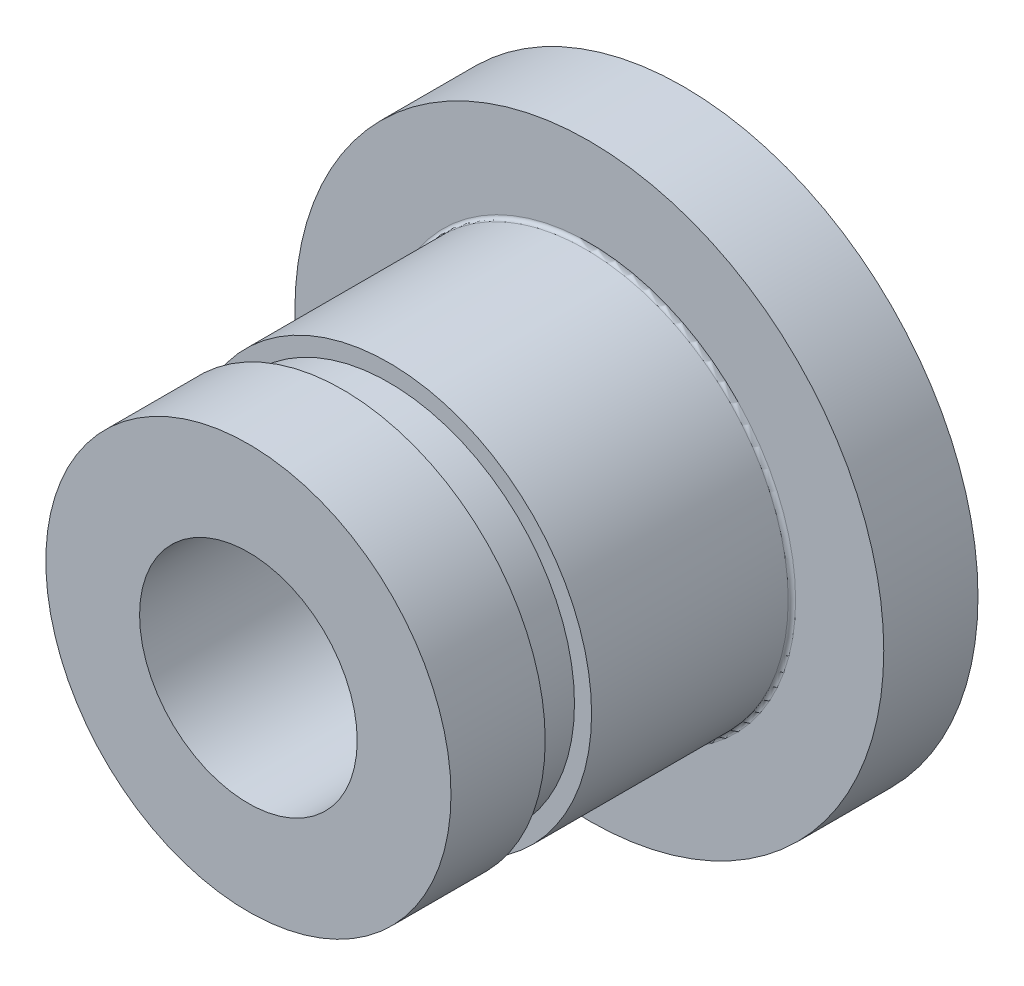
ISO-10303-21;
HEADER;
FILE_DESCRIPTION(('STEP AP214'),'2;1');
FILE_NAME('part.step','',(''),(''),'','','');
FILE_SCHEMA(('AUTOMOTIVE_DESIGN { 1 0 10303 214 1 1 1 1 }'));
ENDSEC;
DATA;
#1=APPLICATION_CONTEXT('core data for automotive mechanical design processes');
#2=APPLICATION_PROTOCOL_DEFINITION('international standard','automotive_design',2000,#1);
#3=PRODUCT_CONTEXT('',#1,'mechanical');
#4=PRODUCT('Part','Part','',(#3));
#5=PRODUCT_RELATED_PRODUCT_CATEGORY('part','',(#4));
#6=PRODUCT_DEFINITION_FORMATION('','',#4);
#7=PRODUCT_DEFINITION_CONTEXT('part definition',#1,'design');
#8=PRODUCT_DEFINITION('design','',#6,#7);
#9=PRODUCT_DEFINITION_SHAPE('','',#8);
#10=(LENGTH_UNIT() NAMED_UNIT(*) SI_UNIT(.MILLI.,.METRE.));
#11=(NAMED_UNIT(*) PLANE_ANGLE_UNIT() SI_UNIT($,.RADIAN.));
#12=(NAMED_UNIT(*) SI_UNIT($,.STERADIAN.) SOLID_ANGLE_UNIT());
#13=UNCERTAINTY_MEASURE_WITH_UNIT(LENGTH_MEASURE(1.E-05),#10,'distance_accuracy_value','');
#14=(GEOMETRIC_REPRESENTATION_CONTEXT(3) GLOBAL_UNCERTAINTY_ASSIGNED_CONTEXT((#13)) GLOBAL_UNIT_ASSIGNED_CONTEXT((#10,
#11,#12)) REPRESENTATION_CONTEXT('',''));
#15=CARTESIAN_POINT('',(0.,0.,0.));
#16=DIRECTION('',(0.,0.,1.));
#17=DIRECTION('',(1.,0.,0.));
#18=AXIS2_PLACEMENT_3D('',#15,#16,#17);
#19=CARTESIAN_POINT('',(0.,5.461,0.));
#20=DIRECTION('',(0.,0.,-1.));
#21=DIRECTION('',(-1.,0.,0.));
#22=AXIS2_PLACEMENT_3D('',#19,#20,#21);
#23=PLANE('',#22);
#24=CARTESIAN_POINT('',(0.,0.,0.));
#25=DIRECTION('',(0.,0.,1.));
#26=DIRECTION('',(1.,0.,0.));
#27=AXIS2_PLACEMENT_3D('',#24,#25,#26);
#28=CIRCLE('',#27,2.9337);
#29=CARTESIAN_POINT('',(2.9337,0.,0.));
#30=VERTEX_POINT('',#29);
#31=EDGE_CURVE('E86',#30,#30,#28,.T.);
#32=ORIENTED_EDGE('',*,*,#31,.F.);
#33=EDGE_LOOP('',(#32));
#34=FACE_BOUND('',#33,.T.);
#35=CARTESIAN_POINT('',(0.,0.,0.));
#36=DIRECTION('',(0.,0.,1.));
#37=DIRECTION('',(1.,0.,0.));
#38=AXIS2_PLACEMENT_3D('',#35,#36,#37);
#39=CIRCLE('',#38,5.461);
#40=CARTESIAN_POINT('',(5.461,0.,0.));
#41=VERTEX_POINT('',#40);
#42=EDGE_CURVE('E12',#41,#41,#39,.T.);
#43=ORIENTED_EDGE('',*,*,#42,.T.);
#44=EDGE_LOOP('',(#43));
#45=FACE_BOUND('',#44,.T.);
#46=ADVANCED_FACE('F49',(#34,#45),#23,.F.);
#47=CARTESIAN_POINT('',(0.,0.,0.));
#48=DIRECTION('',(0.,0.,1.));
#49=DIRECTION('',(1.,0.,0.));
#50=AXIS2_PLACEMENT_3D('',#47,#48,#49);
#51=CYLINDRICAL_SURFACE('',#50,5.461);
#52=ORIENTED_EDGE('',*,*,#42,.F.);
#53=EDGE_LOOP('',(#52));
#54=FACE_BOUND('',#53,.T.);
#55=CARTESIAN_POINT('',(0.,0.,-2.54));
#56=DIRECTION('',(0.,0.,1.));
#57=DIRECTION('',(1.,0.,0.));
#58=AXIS2_PLACEMENT_3D('',#55,#56,#57);
#59=CIRCLE('',#58,5.461);
#60=CARTESIAN_POINT('',(5.461,0.,-2.54));
#61=VERTEX_POINT('',#60);
#62=EDGE_CURVE('E55',#61,#61,#59,.T.);
#63=ORIENTED_EDGE('',*,*,#62,.T.);
#64=EDGE_LOOP('',(#63));
#65=FACE_BOUND('',#64,.T.);
#66=ADVANCED_FACE('F93',(#54,#65),#51,.T.);
#67=CARTESIAN_POINT('',(0.,5.,-2.54));
#68=DIRECTION('',(0.,0.,1.));
#69=DIRECTION('',(1.,0.,0.));
#70=AXIS2_PLACEMENT_3D('',#67,#68,#69);
#71=PLANE('',#70);
#72=ORIENTED_EDGE('',*,*,#62,.F.);
#73=EDGE_LOOP('',(#72));
#74=FACE_BOUND('',#73,.T.);
#75=CARTESIAN_POINT('',(0.,0.,-2.54));
#76=DIRECTION('',(0.,0.,1.));
#77=DIRECTION('',(1.,0.,0.));
#78=AXIS2_PLACEMENT_3D('',#75,#76,#77);
#79=CIRCLE('',#78,5.);
#80=CARTESIAN_POINT('',(5.,0.,-2.54));
#81=VERTEX_POINT('',#80);
#82=EDGE_CURVE('E59',#81,#81,#79,.T.);
#83=ORIENTED_EDGE('',*,*,#82,.T.);
#84=EDGE_LOOP('',(#83));
#85=FACE_BOUND('',#84,.T.);
#86=ADVANCED_FACE('F97',(#74,#85),#71,.F.);
#87=CARTESIAN_POINT('',(0.,0.,0.));
#88=DIRECTION('',(0.,0.,1.));
#89=DIRECTION('',(1.,0.,0.));
#90=AXIS2_PLACEMENT_3D('',#87,#88,#89);
#91=CYLINDRICAL_SURFACE('',#90,5.);
#92=ORIENTED_EDGE('',*,*,#82,.F.);
#93=EDGE_LOOP('',(#92));
#94=FACE_BOUND('',#93,.T.);
#95=CARTESIAN_POINT('',(0.,0.,-3.79));
#96=DIRECTION('',(0.,0.,1.));
#97=DIRECTION('',(1.,0.,0.));
#98=AXIS2_PLACEMENT_3D('',#95,#96,#97);
#99=CIRCLE('',#98,5.);
#100=CARTESIAN_POINT('',(5.,0.,-3.79));
#101=VERTEX_POINT('',#100);
#102=EDGE_CURVE('E63',#101,#101,#99,.T.);
#103=ORIENTED_EDGE('',*,*,#102,.T.);
#104=EDGE_LOOP('',(#103));
#105=FACE_BOUND('',#104,.T.);
#106=ADVANCED_FACE('F102',(#94,#105),#91,.T.);
#107=CARTESIAN_POINT('',(0.,5.461,-3.79));
#108=DIRECTION('',(0.,0.,-1.));
#109=DIRECTION('',(-1.,0.,0.));
#110=AXIS2_PLACEMENT_3D('',#107,#108,#109);
#111=PLANE('',#110);
#112=ORIENTED_EDGE('',*,*,#102,.F.);
#113=EDGE_LOOP('',(#112));
#114=FACE_BOUND('',#113,.T.);
#115=CARTESIAN_POINT('',(0.,0.,-3.79));
#116=DIRECTION('',(0.,0.,1.));
#117=DIRECTION('',(1.,0.,0.));
#118=AXIS2_PLACEMENT_3D('',#115,#116,#117);
#119=CIRCLE('',#118,5.461);
#120=CARTESIAN_POINT('',(5.461,0.,-3.79));
#121=VERTEX_POINT('',#120);
#122=EDGE_CURVE('E68',#121,#121,#119,.T.);
#123=ORIENTED_EDGE('',*,*,#122,.T.);
#124=EDGE_LOOP('',(#123));
#125=FACE_BOUND('',#124,.T.);
#126=ADVANCED_FACE('F108',(#114,#125),#111,.F.);
#127=CARTESIAN_POINT('',(0.,0.,0.));
#128=DIRECTION('',(0.,0.,1.));
#129=DIRECTION('',(1.,0.,0.));
#130=AXIS2_PLACEMENT_3D('',#127,#128,#129);
#131=CYLINDRICAL_SURFACE('',#130,5.461);
#132=ORIENTED_EDGE('',*,*,#122,.F.);
#133=EDGE_LOOP('',(#132));
#134=FACE_BOUND('',#133,.T.);
#135=CARTESIAN_POINT('',(0.,0.,-9.09));
#136=DIRECTION('',(0.,0.,1.));
#137=DIRECTION('',(1.,0.,0.));
#138=AXIS2_PLACEMENT_3D('',#135,#136,#137);
#139=CIRCLE('',#138,5.461);
#140=CARTESIAN_POINT('',(5.461,0.,-9.09));
#141=VERTEX_POINT('',#140);
#142=EDGE_CURVE('E71',#141,#141,#139,.T.);
#143=ORIENTED_EDGE('',*,*,#142,.T.);
#144=EDGE_LOOP('',(#143));
#145=FACE_BOUND('',#144,.T.);
#146=ADVANCED_FACE('F112',(#134,#145),#131,.T.);
#147=CARTESIAN_POINT('',(0.,0.,-9.09));
#148=DIRECTION('',(0.,0.,1.));
#149=DIRECTION('',(1.,0.,0.));
#150=AXIS2_PLACEMENT_3D('',#147,#148,#149);
#151=TOROIDAL_SURFACE('',#150,5.561,0.0999999999999998);
#152=ORIENTED_EDGE('',*,*,#142,.F.);
#153=EDGE_LOOP('',(#152));
#154=FACE_BOUND('',#153,.T.);
#155=CARTESIAN_POINT('',(0.,0.,-9.19));
#156=DIRECTION('',(0.,0.,1.));
#157=DIRECTION('',(1.,0.,0.));
#158=AXIS2_PLACEMENT_3D('',#155,#156,#157);
#159=CIRCLE('',#158,5.561);
#160=CARTESIAN_POINT('',(5.561,0.,-9.19));
#161=VERTEX_POINT('',#160);
#162=EDGE_CURVE('E74',#161,#161,#159,.T.);
#163=ORIENTED_EDGE('',*,*,#162,.T.);
#164=EDGE_LOOP('',(#163));
#165=FACE_BOUND('',#164,.T.);
#166=ADVANCED_FACE('F116',(#154,#165),#151,.F.);
#167=CARTESIAN_POINT('',(0.,7.9375,-9.19));
#168=DIRECTION('',(0.,0.,-1.));
#169=DIRECTION('',(-1.,0.,0.));
#170=AXIS2_PLACEMENT_3D('',#167,#168,#169);
#171=PLANE('',#170);
#172=ORIENTED_EDGE('',*,*,#162,.F.);
#173=EDGE_LOOP('',(#172));
#174=FACE_BOUND('',#173,.T.);
#175=CARTESIAN_POINT('',(0.,0.,-9.19));
#176=DIRECTION('',(0.,0.,1.));
#177=DIRECTION('',(1.,0.,0.));
#178=AXIS2_PLACEMENT_3D('',#175,#176,#177);
#179=CIRCLE('',#178,7.9375);
#180=CARTESIAN_POINT('',(7.9375,0.,-9.19));
#181=VERTEX_POINT('',#180);
#182=EDGE_CURVE('E77',#181,#181,#179,.T.);
#183=ORIENTED_EDGE('',*,*,#182,.T.);
#184=EDGE_LOOP('',(#183));
#185=FACE_BOUND('',#184,.T.);
#186=ADVANCED_FACE('F120',(#174,#185),#171,.F.);
#187=CARTESIAN_POINT('',(0.,0.,0.));
#188=DIRECTION('',(0.,0.,1.));
#189=DIRECTION('',(1.,0.,0.));
#190=AXIS2_PLACEMENT_3D('',#187,#188,#189);
#191=CYLINDRICAL_SURFACE('',#190,7.9375);
#192=ORIENTED_EDGE('',*,*,#182,.F.);
#193=EDGE_LOOP('',(#192));
#194=FACE_BOUND('',#193,.T.);
#195=CARTESIAN_POINT('',(0.,0.,-11.73));
#196=DIRECTION('',(0.,0.,1.));
#197=DIRECTION('',(1.,0.,0.));
#198=AXIS2_PLACEMENT_3D('',#195,#196,#197);
#199=CIRCLE('',#198,7.9375);
#200=CARTESIAN_POINT('',(7.9375,0.,-11.73));
#201=VERTEX_POINT('',#200);
#202=EDGE_CURVE('E80',#201,#201,#199,.T.);
#203=ORIENTED_EDGE('',*,*,#202,.T.);
#204=EDGE_LOOP('',(#203));
#205=FACE_BOUND('',#204,.T.);
#206=ADVANCED_FACE('F124',(#194,#205),#191,.T.);
#207=CARTESIAN_POINT('',(0.,2.9337,-11.73));
#208=DIRECTION('',(0.,0.,1.));
#209=DIRECTION('',(1.,0.,0.));
#210=AXIS2_PLACEMENT_3D('',#207,#208,#209);
#211=PLANE('',#210);
#212=ORIENTED_EDGE('',*,*,#202,.F.);
#213=EDGE_LOOP('',(#212));
#214=FACE_BOUND('',#213,.T.);
#215=CARTESIAN_POINT('',(0.,0.,-11.73));
#216=DIRECTION('',(0.,0.,1.));
#217=DIRECTION('',(1.,0.,0.));
#218=AXIS2_PLACEMENT_3D('',#215,#216,#217);
#219=CIRCLE('',#218,2.9337);
#220=CARTESIAN_POINT('',(2.9337,0.,-11.73));
#221=VERTEX_POINT('',#220);
#222=EDGE_CURVE('E83',#221,#221,#219,.T.);
#223=ORIENTED_EDGE('',*,*,#222,.T.);
#224=EDGE_LOOP('',(#223));
#225=FACE_BOUND('',#224,.T.);
#226=ADVANCED_FACE('F128',(#214,#225),#211,.F.);
#227=CARTESIAN_POINT('',(0.,0.,0.));
#228=DIRECTION('',(0.,0.,1.));
#229=DIRECTION('',(1.,0.,0.));
#230=AXIS2_PLACEMENT_3D('',#227,#228,#229);
#231=CYLINDRICAL_SURFACE('',#230,2.9337);
#232=ORIENTED_EDGE('',*,*,#222,.F.);
#233=EDGE_LOOP('',(#232));
#234=FACE_BOUND('',#233,.T.);
#235=ORIENTED_EDGE('',*,*,#31,.T.);
#236=EDGE_LOOP('',(#235));
#237=FACE_BOUND('',#236,.T.);
#238=ADVANCED_FACE('F90',(#234,#237),#231,.F.);
#239=CLOSED_SHELL('',(#46,#66,#86,#106,#126,#146,#166,#186,#206,#226,#238));
#240=MANIFOLD_SOLID_BREP('B2',#239);
#241=ADVANCED_BREP_SHAPE_REPRESENTATION('',(#18,#240),#14);
#242=SHAPE_DEFINITION_REPRESENTATION(#9,#241);
ENDSEC;
END-ISO-10303-21;
